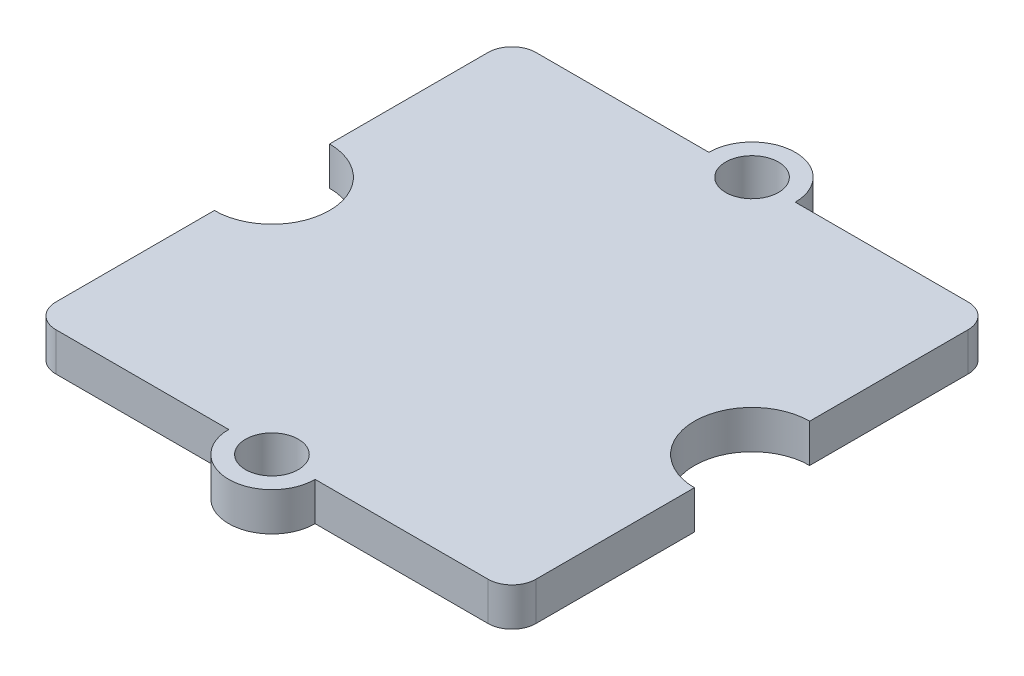
ISO-10303-21;
HEADER;
FILE_DESCRIPTION(('STEP AP214'),'2;1');
FILE_NAME('part.step','',(''),(''),'','','');
FILE_SCHEMA(('AUTOMOTIVE_DESIGN { 1 0 10303 214 1 1 1 1 }'));
ENDSEC;
DATA;
#1=APPLICATION_CONTEXT('core data for automotive mechanical design processes');
#2=APPLICATION_PROTOCOL_DEFINITION('international standard','automotive_design',2000,#1);
#3=PRODUCT_CONTEXT('',#1,'mechanical');
#4=PRODUCT('Part','Part','',(#3));
#5=PRODUCT_RELATED_PRODUCT_CATEGORY('part','',(#4));
#6=PRODUCT_DEFINITION_FORMATION('','',#4);
#7=PRODUCT_DEFINITION_CONTEXT('part definition',#1,'design');
#8=PRODUCT_DEFINITION('design','',#6,#7);
#9=PRODUCT_DEFINITION_SHAPE('','',#8);
#10=(LENGTH_UNIT() NAMED_UNIT(*) SI_UNIT(.MILLI.,.METRE.));
#11=(NAMED_UNIT(*) PLANE_ANGLE_UNIT() SI_UNIT($,.RADIAN.));
#12=(NAMED_UNIT(*) SI_UNIT($,.STERADIAN.) SOLID_ANGLE_UNIT());
#13=UNCERTAINTY_MEASURE_WITH_UNIT(LENGTH_MEASURE(1.E-05),#10,'distance_accuracy_value','');
#14=(GEOMETRIC_REPRESENTATION_CONTEXT(3) GLOBAL_UNCERTAINTY_ASSIGNED_CONTEXT((#13)) GLOBAL_UNIT_ASSIGNED_CONTEXT((#10,
#11,#12)) REPRESENTATION_CONTEXT('',''));
#15=CARTESIAN_POINT('',(0.,0.,0.));
#16=DIRECTION('',(0.,0.,1.));
#17=DIRECTION('',(1.,0.,0.));
#18=AXIS2_PLACEMENT_3D('',#15,#16,#17);
#19=CARTESIAN_POINT('',(0.,1.6,10.));
#20=DIRECTION('',(0.,-1.,0.));
#21=DIRECTION('',(0.,0.,-1.));
#22=AXIS2_PLACEMENT_3D('',#19,#20,#21);
#23=CYLINDRICAL_SURFACE('',#22,1.8);
#24=CARTESIAN_POINT('',(0.,0.,10.));
#25=DIRECTION('',(0.,1.,0.));
#26=DIRECTION('',(0.,0.,1.));
#27=AXIS2_PLACEMENT_3D('',#24,#25,#26);
#28=CIRCLE('',#27,1.8);
#29=CARTESIAN_POINT('',(-1.8,0.,10.));
#30=VERTEX_POINT('',#29);
#31=CARTESIAN_POINT('',(1.8,0.,10.));
#32=VERTEX_POINT('',#31);
#33=EDGE_CURVE('E187',#30,#32,#28,.T.);
#34=ORIENTED_EDGE('',*,*,#33,.T.);
#35=DIRECTION('',(0.,-1.,0.));
#36=VECTOR('',#35,1.);
#37=CARTESIAN_POINT('',(1.8,1.6,10.));
#38=LINE('',#37,#36);
#39=CARTESIAN_POINT('',(1.8,1.6,10.));
#40=VERTEX_POINT('',#39);
#41=EDGE_CURVE('E11',#40,#32,#38,.T.);
#42=ORIENTED_EDGE('',*,*,#41,.F.);
#43=CARTESIAN_POINT('',(0.,1.6,10.));
#44=DIRECTION('',(0.,1.,0.));
#45=DIRECTION('',(0.,0.,1.));
#46=AXIS2_PLACEMENT_3D('',#43,#44,#45);
#47=CIRCLE('',#46,1.8);
#48=CARTESIAN_POINT('',(-1.8,1.6,10.));
#49=VERTEX_POINT('',#48);
#50=EDGE_CURVE('E228',#49,#40,#47,.T.);
#51=ORIENTED_EDGE('',*,*,#50,.F.);
#52=DIRECTION('',(0.,-1.,0.));
#53=VECTOR('',#52,1.);
#54=CARTESIAN_POINT('',(-1.8,1.6,10.));
#55=LINE('',#54,#53);
#56=EDGE_CURVE('E186',#49,#30,#55,.T.);
#57=ORIENTED_EDGE('',*,*,#56,.T.);
#58=EDGE_LOOP('',(#34,#42,#51,#57));
#59=FACE_BOUND('',#58,.T.);
#60=ADVANCED_FACE('F36',(#59),#23,.T.);
#61=CARTESIAN_POINT('',(0.,1.6,10.));
#62=DIRECTION('',(0.,0.,-1.));
#63=DIRECTION('',(-1.,0.,0.));
#64=AXIS2_PLACEMENT_3D('',#61,#62,#63);
#65=PLANE('',#64);
#66=DIRECTION('',(1.,0.,0.));
#67=VECTOR('',#66,1.);
#68=CARTESIAN_POINT('',(0.,0.,10.));
#69=LINE('',#68,#67);
#70=CARTESIAN_POINT('',(8.99999999999999,0.,10.));
#71=VERTEX_POINT('',#70);
#72=EDGE_CURVE('E190',#32,#71,#69,.T.);
#73=ORIENTED_EDGE('',*,*,#72,.T.);
#74=DIRECTION('',(0.,-1.,0.));
#75=VECTOR('',#74,1.);
#76=CARTESIAN_POINT('',(8.99999999999999,1.6,10.));
#77=LINE('',#76,#75);
#78=CARTESIAN_POINT('',(8.99999999999999,1.6,10.));
#79=VERTEX_POINT('',#78);
#80=EDGE_CURVE('E44',#79,#71,#77,.T.);
#81=ORIENTED_EDGE('',*,*,#80,.F.);
#82=DIRECTION('',(1.,0.,0.));
#83=VECTOR('',#82,1.);
#84=CARTESIAN_POINT('',(0.,1.6,10.));
#85=LINE('',#84,#83);
#86=EDGE_CURVE('E115',#40,#79,#85,.T.);
#87=ORIENTED_EDGE('',*,*,#86,.F.);
#88=ORIENTED_EDGE('',*,*,#41,.T.);
#89=EDGE_LOOP('',(#73,#81,#87,#88));
#90=FACE_BOUND('',#89,.T.);
#91=ADVANCED_FACE('F308',(#90),#65,.F.);
#92=CARTESIAN_POINT('',(9.,1.6,9.00000000000001));
#93=DIRECTION('',(0.,-1.,0.));
#94=DIRECTION('',(0.,0.,-1.));
#95=AXIS2_PLACEMENT_3D('',#92,#93,#94);
#96=CYLINDRICAL_SURFACE('',#95,1.);
#97=CARTESIAN_POINT('',(9.,0.,9.00000000000001));
#98=DIRECTION('',(0.,1.,0.));
#99=DIRECTION('',(0.,0.,1.));
#100=AXIS2_PLACEMENT_3D('',#97,#98,#99);
#101=CIRCLE('',#100,1.);
#102=CARTESIAN_POINT('',(10.,0.,9.));
#103=VERTEX_POINT('',#102);
#104=EDGE_CURVE('E192',#71,#103,#101,.T.);
#105=ORIENTED_EDGE('',*,*,#104,.T.);
#106=DIRECTION('',(0.,-1.,0.));
#107=VECTOR('',#106,1.);
#108=CARTESIAN_POINT('',(10.,1.6,9.));
#109=LINE('',#108,#107);
#110=CARTESIAN_POINT('',(10.,1.6,9.));
#111=VERTEX_POINT('',#110);
#112=EDGE_CURVE('E250',#111,#103,#109,.T.);
#113=ORIENTED_EDGE('',*,*,#112,.F.);
#114=CARTESIAN_POINT('',(9.,1.6,9.00000000000001));
#115=DIRECTION('',(0.,1.,0.));
#116=DIRECTION('',(0.,0.,1.));
#117=AXIS2_PLACEMENT_3D('',#114,#115,#116);
#118=CIRCLE('',#117,1.);
#119=EDGE_CURVE('E258',#79,#111,#118,.T.);
#120=ORIENTED_EDGE('',*,*,#119,.F.);
#121=ORIENTED_EDGE('',*,*,#80,.T.);
#122=EDGE_LOOP('',(#105,#113,#120,#121));
#123=FACE_BOUND('',#122,.T.);
#124=ADVANCED_FACE('F256',(#123),#96,.T.);
#125=CARTESIAN_POINT('',(10.,1.6,0.));
#126=DIRECTION('',(-1.,0.,0.));
#127=DIRECTION('',(0.,0.,1.));
#128=AXIS2_PLACEMENT_3D('',#125,#126,#127);
#129=PLANE('',#128);
#130=DIRECTION('',(0.,0.,-1.));
#131=VECTOR('',#130,1.);
#132=CARTESIAN_POINT('',(10.,0.,0.));
#133=LINE('',#132,#131);
#134=CARTESIAN_POINT('',(10.,0.,2.40000000000001));
#135=VERTEX_POINT('',#134);
#136=EDGE_CURVE('E194',#103,#135,#133,.T.);
#137=ORIENTED_EDGE('',*,*,#136,.T.);
#138=DIRECTION('',(0.,-1.,0.));
#139=VECTOR('',#138,1.);
#140=CARTESIAN_POINT('',(10.,1.6,2.40000000000001));
#141=LINE('',#140,#139);
#142=CARTESIAN_POINT('',(10.,1.6,2.40000000000001));
#143=VERTEX_POINT('',#142);
#144=EDGE_CURVE('E248',#143,#135,#141,.T.);
#145=ORIENTED_EDGE('',*,*,#144,.F.);
#146=DIRECTION('',(0.,0.,-1.));
#147=VECTOR('',#146,1.);
#148=CARTESIAN_POINT('',(10.,1.6,0.));
#149=LINE('',#148,#147);
#150=EDGE_CURVE('E271',#111,#143,#149,.T.);
#151=ORIENTED_EDGE('',*,*,#150,.F.);
#152=ORIENTED_EDGE('',*,*,#112,.T.);
#153=EDGE_LOOP('',(#137,#145,#151,#152));
#154=FACE_BOUND('',#153,.T.);
#155=ADVANCED_FACE('F268',(#154),#129,.F.);
#156=CARTESIAN_POINT('',(10.,1.6,0.));
#157=DIRECTION('',(0.,-1.,0.));
#158=DIRECTION('',(0.,0.,-1.));
#159=AXIS2_PLACEMENT_3D('',#156,#157,#158);
#160=CYLINDRICAL_SURFACE('',#159,2.4);
#161=CARTESIAN_POINT('',(10.,0.,0.));
#162=DIRECTION('',(0.,1.,0.));
#163=DIRECTION('',(0.,0.,1.));
#164=AXIS2_PLACEMENT_3D('',#161,#162,#163);
#165=CIRCLE('',#164,2.4);
#166=CARTESIAN_POINT('',(10.,0.,-2.39999999999999));
#167=VERTEX_POINT('',#166);
#168=EDGE_CURVE('E197',#167,#135,#165,.T.);
#169=ORIENTED_EDGE('',*,*,#168,.F.);
#170=DIRECTION('',(0.,-1.,0.));
#171=VECTOR('',#170,1.);
#172=CARTESIAN_POINT('',(10.,1.6,-2.39999999999999));
#173=LINE('',#172,#171);
#174=CARTESIAN_POINT('',(10.,1.6,-2.39999999999999));
#175=VERTEX_POINT('',#174);
#176=EDGE_CURVE('E246',#175,#167,#173,.T.);
#177=ORIENTED_EDGE('',*,*,#176,.F.);
#178=CARTESIAN_POINT('',(10.,1.6,0.));
#179=DIRECTION('',(0.,1.,0.));
#180=DIRECTION('',(0.,0.,1.));
#181=AXIS2_PLACEMENT_3D('',#178,#179,#180);
#182=CIRCLE('',#181,2.4);
#183=EDGE_CURVE('E273',#175,#143,#182,.T.);
#184=ORIENTED_EDGE('',*,*,#183,.T.);
#185=ORIENTED_EDGE('',*,*,#144,.T.);
#186=EDGE_LOOP('',(#169,#177,#184,#185));
#187=FACE_BOUND('',#186,.T.);
#188=ADVANCED_FACE('F337',(#187),#160,.F.);
#189=CARTESIAN_POINT('',(10.,0.,-8.99999999999999));
#190=VERTEX_POINT('',#189);
#191=EDGE_CURVE('E198',#167,#190,#133,.T.);
#192=ORIENTED_EDGE('',*,*,#191,.T.);
#193=DIRECTION('',(0.,-1.,0.));
#194=VECTOR('',#193,1.);
#195=CARTESIAN_POINT('',(10.,1.6,-8.99999999999999));
#196=LINE('',#195,#194);
#197=CARTESIAN_POINT('',(10.,1.6,-8.99999999999999));
#198=VERTEX_POINT('',#197);
#199=EDGE_CURVE('E244',#198,#190,#196,.T.);
#200=ORIENTED_EDGE('',*,*,#199,.F.);
#201=EDGE_CURVE('E275',#175,#198,#149,.T.);
#202=ORIENTED_EDGE('',*,*,#201,.F.);
#203=ORIENTED_EDGE('',*,*,#176,.T.);
#204=EDGE_LOOP('',(#192,#200,#202,#203));
#205=FACE_BOUND('',#204,.T.);
#206=ADVANCED_FACE('F339',(#205),#129,.F.);
#207=CARTESIAN_POINT('',(9.,1.6,-8.99999999999999));
#208=DIRECTION('',(0.,-1.,0.));
#209=DIRECTION('',(0.,0.,-1.));
#210=AXIS2_PLACEMENT_3D('',#207,#208,#209);
#211=CYLINDRICAL_SURFACE('',#210,1.);
#212=CARTESIAN_POINT('',(9.,0.,-8.99999999999999));
#213=DIRECTION('',(0.,1.,0.));
#214=DIRECTION('',(0.,0.,1.));
#215=AXIS2_PLACEMENT_3D('',#212,#213,#214);
#216=CIRCLE('',#215,1.);
#217=CARTESIAN_POINT('',(8.99999999999999,0.,-9.99999999999999));
#218=VERTEX_POINT('',#217);
#219=EDGE_CURVE('E201',#218,#190,#216,.F.);
#220=ORIENTED_EDGE('',*,*,#219,.F.);
#221=DIRECTION('',(0.,-1.,0.));
#222=VECTOR('',#221,1.);
#223=CARTESIAN_POINT('',(8.99999999999999,1.6,-9.99999999999999));
#224=LINE('',#223,#222);
#225=CARTESIAN_POINT('',(8.99999999999999,1.6,-9.99999999999999));
#226=VERTEX_POINT('',#225);
#227=EDGE_CURVE('E242',#226,#218,#224,.T.);
#228=ORIENTED_EDGE('',*,*,#227,.F.);
#229=CARTESIAN_POINT('',(9.,1.6,-8.99999999999999));
#230=DIRECTION('',(0.,1.,0.));
#231=DIRECTION('',(0.,0.,1.));
#232=AXIS2_PLACEMENT_3D('',#229,#230,#231);
#233=CIRCLE('',#232,1.);
#234=EDGE_CURVE('E278',#226,#198,#233,.F.);
#235=ORIENTED_EDGE('',*,*,#234,.T.);
#236=ORIENTED_EDGE('',*,*,#199,.T.);
#237=EDGE_LOOP('',(#220,#228,#235,#236));
#238=FACE_BOUND('',#237,.T.);
#239=ADVANCED_FACE('F352',(#238),#211,.T.);
#240=CARTESIAN_POINT('',(0.,1.6,-9.99999999999999));
#241=DIRECTION('',(0.,0.,-1.));
#242=DIRECTION('',(-1.,0.,0.));
#243=AXIS2_PLACEMENT_3D('',#240,#241,#242);
#244=PLANE('',#243);
#245=DIRECTION('',(1.,0.,0.));
#246=VECTOR('',#245,1.);
#247=CARTESIAN_POINT('',(0.,0.,-9.99999999999999));
#248=LINE('',#247,#246);
#249=CARTESIAN_POINT('',(1.8,0.,-9.99999999999999));
#250=VERTEX_POINT('',#249);
#251=EDGE_CURVE('E204',#250,#218,#248,.T.);
#252=ORIENTED_EDGE('',*,*,#251,.F.);
#253=DIRECTION('',(0.,-1.,0.));
#254=VECTOR('',#253,1.);
#255=CARTESIAN_POINT('',(1.8,1.6,-9.99999999999999));
#256=LINE('',#255,#254);
#257=CARTESIAN_POINT('',(1.8,1.6,-9.99999999999999));
#258=VERTEX_POINT('',#257);
#259=EDGE_CURVE('E240',#258,#250,#256,.T.);
#260=ORIENTED_EDGE('',*,*,#259,.F.);
#261=DIRECTION('',(1.,0.,0.));
#262=VECTOR('',#261,1.);
#263=CARTESIAN_POINT('',(0.,1.6,-9.99999999999999));
#264=LINE('',#263,#262);
#265=EDGE_CURVE('E283',#258,#226,#264,.T.);
#266=ORIENTED_EDGE('',*,*,#265,.T.);
#267=ORIENTED_EDGE('',*,*,#227,.T.);
#268=EDGE_LOOP('',(#252,#260,#266,#267));
#269=FACE_BOUND('',#268,.T.);
#270=ADVANCED_FACE('F359',(#269),#244,.T.);
#271=CARTESIAN_POINT('',(0.,1.6,-9.99999999999999));
#272=DIRECTION('',(0.,-1.,0.));
#273=DIRECTION('',(0.,0.,-1.));
#274=AXIS2_PLACEMENT_3D('',#271,#272,#273);
#275=CYLINDRICAL_SURFACE('',#274,1.8);
#276=CARTESIAN_POINT('',(0.,0.,-9.99999999999999));
#277=DIRECTION('',(0.,1.,0.));
#278=DIRECTION('',(0.,0.,1.));
#279=AXIS2_PLACEMENT_3D('',#276,#277,#278);
#280=CIRCLE('',#279,1.8);
#281=CARTESIAN_POINT('',(-1.8,0.,-9.99999999999999));
#282=VERTEX_POINT('',#281);
#283=EDGE_CURVE('E207',#250,#282,#280,.T.);
#284=ORIENTED_EDGE('',*,*,#283,.T.);
#285=DIRECTION('',(0.,-1.,0.));
#286=VECTOR('',#285,1.);
#287=CARTESIAN_POINT('',(-1.8,1.6,-9.99999999999999));
#288=LINE('',#287,#286);
#289=CARTESIAN_POINT('',(-1.8,1.6,-9.99999999999999));
#290=VERTEX_POINT('',#289);
#291=EDGE_CURVE('E238',#290,#282,#288,.T.);
#292=ORIENTED_EDGE('',*,*,#291,.F.);
#293=CARTESIAN_POINT('',(0.,1.6,-9.99999999999999));
#294=DIRECTION('',(0.,1.,0.));
#295=DIRECTION('',(0.,0.,1.));
#296=AXIS2_PLACEMENT_3D('',#293,#294,#295);
#297=CIRCLE('',#296,1.8);
#298=EDGE_CURVE('E287',#258,#290,#297,.T.);
#299=ORIENTED_EDGE('',*,*,#298,.F.);
#300=ORIENTED_EDGE('',*,*,#259,.T.);
#301=EDGE_LOOP('',(#284,#292,#299,#300));
#302=FACE_BOUND('',#301,.T.);
#303=ADVANCED_FACE('F366',(#302),#275,.T.);
#304=CARTESIAN_POINT('',(-8.99999999999999,0.,-9.99999999999999));
#305=VERTEX_POINT('',#304);
#306=EDGE_CURVE('E208',#305,#282,#248,.T.);
#307=ORIENTED_EDGE('',*,*,#306,.F.);
#308=DIRECTION('',(0.,-1.,0.));
#309=VECTOR('',#308,1.);
#310=CARTESIAN_POINT('',(-8.99999999999999,1.6,-9.99999999999999));
#311=LINE('',#310,#309);
#312=CARTESIAN_POINT('',(-8.99999999999999,1.6,-9.99999999999999));
#313=VERTEX_POINT('',#312);
#314=EDGE_CURVE('E236',#313,#305,#311,.T.);
#315=ORIENTED_EDGE('',*,*,#314,.F.);
#316=EDGE_CURVE('E289',#313,#290,#264,.T.);
#317=ORIENTED_EDGE('',*,*,#316,.T.);
#318=ORIENTED_EDGE('',*,*,#291,.T.);
#319=EDGE_LOOP('',(#307,#315,#317,#318));
#320=FACE_BOUND('',#319,.T.);
#321=ADVANCED_FACE('F369',(#320),#244,.T.);
#322=CARTESIAN_POINT('',(-9.,1.6,-8.99999999999999));
#323=DIRECTION('',(0.,-1.,0.));
#324=DIRECTION('',(0.,0.,-1.));
#325=AXIS2_PLACEMENT_3D('',#322,#323,#324);
#326=CYLINDRICAL_SURFACE('',#325,1.);
#327=CARTESIAN_POINT('',(-9.,0.,-8.99999999999999));
#328=DIRECTION('',(0.,1.,0.));
#329=DIRECTION('',(0.,0.,1.));
#330=AXIS2_PLACEMENT_3D('',#327,#328,#329);
#331=CIRCLE('',#330,1.);
#332=CARTESIAN_POINT('',(-10.,0.,-8.99999999999999));
#333=VERTEX_POINT('',#332);
#334=EDGE_CURVE('E211',#333,#305,#331,.F.);
#335=ORIENTED_EDGE('',*,*,#334,.F.);
#336=DIRECTION('',(0.,-1.,0.));
#337=VECTOR('',#336,1.);
#338=CARTESIAN_POINT('',(-10.,1.6,-8.99999999999999));
#339=LINE('',#338,#337);
#340=CARTESIAN_POINT('',(-10.,1.6,-8.99999999999999));
#341=VERTEX_POINT('',#340);
#342=EDGE_CURVE('E234',#341,#333,#339,.T.);
#343=ORIENTED_EDGE('',*,*,#342,.F.);
#344=CARTESIAN_POINT('',(-9.,1.6,-8.99999999999999));
#345=DIRECTION('',(0.,1.,0.));
#346=DIRECTION('',(0.,0.,1.));
#347=AXIS2_PLACEMENT_3D('',#344,#345,#346);
#348=CIRCLE('',#347,1.);
#349=EDGE_CURVE('E292',#341,#313,#348,.F.);
#350=ORIENTED_EDGE('',*,*,#349,.T.);
#351=ORIENTED_EDGE('',*,*,#314,.T.);
#352=EDGE_LOOP('',(#335,#343,#350,#351));
#353=FACE_BOUND('',#352,.T.);
#354=ADVANCED_FACE('F382',(#353),#326,.T.);
#355=CARTESIAN_POINT('',(-10.,1.6,0.));
#356=DIRECTION('',(-1.,0.,0.));
#357=DIRECTION('',(0.,0.,1.));
#358=AXIS2_PLACEMENT_3D('',#355,#356,#357);
#359=PLANE('',#358);
#360=DIRECTION('',(0.,0.,-1.));
#361=VECTOR('',#360,1.);
#362=CARTESIAN_POINT('',(-10.,0.,0.));
#363=LINE('',#362,#361);
#364=CARTESIAN_POINT('',(-10.,0.,-2.39999999999999));
#365=VERTEX_POINT('',#364);
#366=EDGE_CURVE('E214',#365,#333,#363,.T.);
#367=ORIENTED_EDGE('',*,*,#366,.F.);
#368=DIRECTION('',(0.,-1.,0.));
#369=VECTOR('',#368,1.);
#370=CARTESIAN_POINT('',(-10.,1.6,-2.39999999999999));
#371=LINE('',#370,#369);
#372=CARTESIAN_POINT('',(-10.,1.6,-2.39999999999999));
#373=VERTEX_POINT('',#372);
#374=EDGE_CURVE('E232',#373,#365,#371,.T.);
#375=ORIENTED_EDGE('',*,*,#374,.F.);
#376=DIRECTION('',(0.,0.,-1.));
#377=VECTOR('',#376,1.);
#378=CARTESIAN_POINT('',(-10.,1.6,0.));
#379=LINE('',#378,#377);
#380=EDGE_CURVE('E174',#373,#341,#379,.T.);
#381=ORIENTED_EDGE('',*,*,#380,.T.);
#382=ORIENTED_EDGE('',*,*,#342,.T.);
#383=EDGE_LOOP('',(#367,#375,#381,#382));
#384=FACE_BOUND('',#383,.T.);
#385=ADVANCED_FACE('F389',(#384),#359,.T.);
#386=CARTESIAN_POINT('',(-10.,1.6,0.));
#387=DIRECTION('',(0.,-1.,0.));
#388=DIRECTION('',(0.,0.,-1.));
#389=AXIS2_PLACEMENT_3D('',#386,#387,#388);
#390=CYLINDRICAL_SURFACE('',#389,2.4);
#391=CARTESIAN_POINT('',(-10.,0.,0.));
#392=DIRECTION('',(0.,1.,0.));
#393=DIRECTION('',(0.,0.,1.));
#394=AXIS2_PLACEMENT_3D('',#391,#392,#393);
#395=CIRCLE('',#394,2.4);
#396=CARTESIAN_POINT('',(-10.,0.,2.40000000000001));
#397=VERTEX_POINT('',#396);
#398=EDGE_CURVE('E217',#397,#365,#395,.T.);
#399=ORIENTED_EDGE('',*,*,#398,.F.);
#400=DIRECTION('',(0.,-1.,0.));
#401=VECTOR('',#400,1.);
#402=CARTESIAN_POINT('',(-10.,1.6,2.40000000000001));
#403=LINE('',#402,#401);
#404=CARTESIAN_POINT('',(-10.,1.6,2.40000000000001));
#405=VERTEX_POINT('',#404);
#406=EDGE_CURVE('E164',#405,#397,#403,.T.);
#407=ORIENTED_EDGE('',*,*,#406,.F.);
#408=CARTESIAN_POINT('',(-10.,1.6,0.));
#409=DIRECTION('',(0.,1.,0.));
#410=DIRECTION('',(0.,0.,1.));
#411=AXIS2_PLACEMENT_3D('',#408,#409,#410);
#412=CIRCLE('',#411,2.4);
#413=EDGE_CURVE('E172',#405,#373,#412,.T.);
#414=ORIENTED_EDGE('',*,*,#413,.T.);
#415=ORIENTED_EDGE('',*,*,#374,.T.);
#416=EDGE_LOOP('',(#399,#407,#414,#415));
#417=FACE_BOUND('',#416,.T.);
#418=ADVANCED_FACE('F298',(#417),#390,.F.);
#419=CARTESIAN_POINT('',(-10.,0.,9.));
#420=VERTEX_POINT('',#419);
#421=EDGE_CURVE('E159',#420,#397,#363,.T.);
#422=ORIENTED_EDGE('',*,*,#421,.F.);
#423=DIRECTION('',(0.,-1.,0.));
#424=VECTOR('',#423,1.);
#425=CARTESIAN_POINT('',(-10.,1.6,9.));
#426=LINE('',#425,#424);
#427=CARTESIAN_POINT('',(-10.,1.6,9.));
#428=VERTEX_POINT('',#427);
#429=EDGE_CURVE('E154',#428,#420,#426,.T.);
#430=ORIENTED_EDGE('',*,*,#429,.F.);
#431=EDGE_CURVE('E157',#428,#405,#379,.T.);
#432=ORIENTED_EDGE('',*,*,#431,.T.);
#433=ORIENTED_EDGE('',*,*,#406,.T.);
#434=EDGE_LOOP('',(#422,#430,#432,#433));
#435=FACE_BOUND('',#434,.T.);
#436=ADVANCED_FACE('F156',(#435),#359,.T.);
#437=CARTESIAN_POINT('',(-9.,1.6,9.00000000000001));
#438=DIRECTION('',(0.,-1.,0.));
#439=DIRECTION('',(0.,0.,-1.));
#440=AXIS2_PLACEMENT_3D('',#437,#438,#439);
#441=CYLINDRICAL_SURFACE('',#440,1.);
#442=CARTESIAN_POINT('',(-9.,0.,9.00000000000001));
#443=DIRECTION('',(0.,1.,0.));
#444=DIRECTION('',(0.,0.,1.));
#445=AXIS2_PLACEMENT_3D('',#442,#443,#444);
#446=CIRCLE('',#445,1.);
#447=CARTESIAN_POINT('',(-8.99999999999999,0.,10.));
#448=VERTEX_POINT('',#447);
#449=EDGE_CURVE('E220',#448,#420,#446,.F.);
#450=ORIENTED_EDGE('',*,*,#449,.F.);
#451=DIRECTION('',(0.,-1.,0.));
#452=VECTOR('',#451,1.);
#453=CARTESIAN_POINT('',(-8.99999999999999,1.6,10.));
#454=LINE('',#453,#452);
#455=CARTESIAN_POINT('',(-8.99999999999999,1.6,10.));
#456=VERTEX_POINT('',#455);
#457=EDGE_CURVE('E104',#456,#448,#454,.T.);
#458=ORIENTED_EDGE('',*,*,#457,.F.);
#459=CARTESIAN_POINT('',(-9.,1.6,9.00000000000001));
#460=DIRECTION('',(0.,1.,0.));
#461=DIRECTION('',(0.,0.,1.));
#462=AXIS2_PLACEMENT_3D('',#459,#460,#461);
#463=CIRCLE('',#462,1.);
#464=EDGE_CURVE('E169',#456,#428,#463,.F.);
#465=ORIENTED_EDGE('',*,*,#464,.T.);
#466=ORIENTED_EDGE('',*,*,#429,.T.);
#467=EDGE_LOOP('',(#450,#458,#465,#466));
#468=FACE_BOUND('',#467,.T.);
#469=ADVANCED_FACE('F175',(#468),#441,.T.);
#470=CARTESIAN_POINT('',(0.,1.6,-9.99999999999999));
#471=DIRECTION('',(0.,-1.,0.));
#472=DIRECTION('',(0.,0.,-1.));
#473=AXIS2_PLACEMENT_3D('',#470,#471,#472);
#474=CYLINDRICAL_SURFACE('',#473,1.1);
#475=CARTESIAN_POINT('',(0.,1.6,-9.99999999999999));
#476=DIRECTION('',(0.,1.,0.));
#477=DIRECTION('',(0.,0.,1.));
#478=AXIS2_PLACEMENT_3D('',#475,#476,#477);
#479=CIRCLE('',#478,1.1);
#480=CARTESIAN_POINT('',(0.,1.6,-8.9));
#481=VERTEX_POINT('',#480);
#482=EDGE_CURVE('E177',#481,#481,#479,.T.);
#483=ORIENTED_EDGE('',*,*,#482,.T.);
#484=EDGE_LOOP('',(#483));
#485=FACE_BOUND('',#484,.T.);
#486=CARTESIAN_POINT('',(0.,0.,-9.99999999999999));
#487=DIRECTION('',(0.,1.,0.));
#488=DIRECTION('',(0.,0.,1.));
#489=AXIS2_PLACEMENT_3D('',#486,#487,#488);
#490=CIRCLE('',#489,1.1);
#491=CARTESIAN_POINT('',(0.,0.,-8.9));
#492=VERTEX_POINT('',#491);
#493=EDGE_CURVE('E222',#492,#492,#490,.T.);
#494=ORIENTED_EDGE('',*,*,#493,.F.);
#495=EDGE_LOOP('',(#494));
#496=FACE_BOUND('',#495,.T.);
#497=ADVANCED_FACE('F306',(#485,#496),#474,.F.);
#498=EDGE_CURVE('E107',#448,#30,#69,.T.);
#499=ORIENTED_EDGE('',*,*,#498,.T.);
#500=ORIENTED_EDGE('',*,*,#56,.F.);
#501=EDGE_CURVE('E52',#456,#49,#85,.T.);
#502=ORIENTED_EDGE('',*,*,#501,.F.);
#503=ORIENTED_EDGE('',*,*,#457,.T.);
#504=EDGE_LOOP('',(#499,#500,#502,#503));
#505=FACE_BOUND('',#504,.T.);
#506=ADVANCED_FACE('F303',(#505),#65,.F.);
#507=CARTESIAN_POINT('',(0.,1.6,10.));
#508=DIRECTION('',(0.,-1.,0.));
#509=DIRECTION('',(0.,0.,-1.));
#510=AXIS2_PLACEMENT_3D('',#507,#508,#509);
#511=CYLINDRICAL_SURFACE('',#510,1.1);
#512=CARTESIAN_POINT('',(0.,1.6,10.));
#513=DIRECTION('',(0.,1.,0.));
#514=DIRECTION('',(0.,0.,1.));
#515=AXIS2_PLACEMENT_3D('',#512,#513,#514);
#516=CIRCLE('',#515,1.1);
#517=CARTESIAN_POINT('',(0.,1.6,11.1));
#518=VERTEX_POINT('',#517);
#519=EDGE_CURVE('E183',#518,#518,#516,.T.);
#520=ORIENTED_EDGE('',*,*,#519,.T.);
#521=EDGE_LOOP('',(#520));
#522=FACE_BOUND('',#521,.T.);
#523=CARTESIAN_POINT('',(0.,0.,10.));
#524=DIRECTION('',(0.,1.,0.));
#525=DIRECTION('',(0.,0.,1.));
#526=AXIS2_PLACEMENT_3D('',#523,#524,#525);
#527=CIRCLE('',#526,1.1);
#528=CARTESIAN_POINT('',(0.,0.,11.1));
#529=VERTEX_POINT('',#528);
#530=EDGE_CURVE('E225',#529,#529,#527,.T.);
#531=ORIENTED_EDGE('',*,*,#530,.F.);
#532=EDGE_LOOP('',(#531));
#533=FACE_BOUND('',#532,.T.);
#534=ADVANCED_FACE('F305',(#522,#533),#511,.F.);
#535=CARTESIAN_POINT('',(0.,1.6,0.));
#536=DIRECTION('',(0.,1.,0.));
#537=DIRECTION('',(0.,0.,1.));
#538=AXIS2_PLACEMENT_3D('',#535,#536,#537);
#539=PLANE('',#538);
#540=ORIENTED_EDGE('',*,*,#50,.T.);
#541=ORIENTED_EDGE('',*,*,#86,.T.);
#542=ORIENTED_EDGE('',*,*,#119,.T.);
#543=ORIENTED_EDGE('',*,*,#150,.T.);
#544=ORIENTED_EDGE('',*,*,#183,.F.);
#545=ORIENTED_EDGE('',*,*,#201,.T.);
#546=ORIENTED_EDGE('',*,*,#234,.F.);
#547=ORIENTED_EDGE('',*,*,#265,.F.);
#548=ORIENTED_EDGE('',*,*,#298,.T.);
#549=ORIENTED_EDGE('',*,*,#316,.F.);
#550=ORIENTED_EDGE('',*,*,#349,.F.);
#551=ORIENTED_EDGE('',*,*,#380,.F.);
#552=ORIENTED_EDGE('',*,*,#413,.F.);
#553=ORIENTED_EDGE('',*,*,#431,.F.);
#554=ORIENTED_EDGE('',*,*,#464,.F.);
#555=ORIENTED_EDGE('',*,*,#501,.T.);
#556=EDGE_LOOP('',(#540,#541,#542,#543,#544,#545,#546,#547,#548,#549,#550,#551,#552,#553,#554,#555));
#557=FACE_BOUND('',#556,.T.);
#558=ORIENTED_EDGE('',*,*,#482,.F.);
#559=EDGE_LOOP('',(#558));
#560=FACE_BOUND('',#559,.T.);
#561=ORIENTED_EDGE('',*,*,#519,.F.);
#562=EDGE_LOOP('',(#561));
#563=FACE_BOUND('',#562,.T.);
#564=ADVANCED_FACE('F167',(#557,#560,#563),#539,.T.);
#565=CARTESIAN_POINT('',(0.,0.,0.));
#566=DIRECTION('',(0.,1.,0.));
#567=DIRECTION('',(0.,0.,1.));
#568=AXIS2_PLACEMENT_3D('',#565,#566,#567);
#569=PLANE('',#568);
#570=ORIENTED_EDGE('',*,*,#33,.F.);
#571=ORIENTED_EDGE('',*,*,#498,.F.);
#572=ORIENTED_EDGE('',*,*,#449,.T.);
#573=ORIENTED_EDGE('',*,*,#421,.T.);
#574=ORIENTED_EDGE('',*,*,#398,.T.);
#575=ORIENTED_EDGE('',*,*,#366,.T.);
#576=ORIENTED_EDGE('',*,*,#334,.T.);
#577=ORIENTED_EDGE('',*,*,#306,.T.);
#578=ORIENTED_EDGE('',*,*,#283,.F.);
#579=ORIENTED_EDGE('',*,*,#251,.T.);
#580=ORIENTED_EDGE('',*,*,#219,.T.);
#581=ORIENTED_EDGE('',*,*,#191,.F.);
#582=ORIENTED_EDGE('',*,*,#168,.T.);
#583=ORIENTED_EDGE('',*,*,#136,.F.);
#584=ORIENTED_EDGE('',*,*,#104,.F.);
#585=ORIENTED_EDGE('',*,*,#72,.F.);
#586=EDGE_LOOP('',(#570,#571,#572,#573,#574,#575,#576,#577,#578,#579,#580,#581,#582,#583,#584,#585));
#587=FACE_BOUND('',#586,.T.);
#588=ORIENTED_EDGE('',*,*,#493,.T.);
#589=EDGE_LOOP('',(#588));
#590=FACE_BOUND('',#589,.T.);
#591=ORIENTED_EDGE('',*,*,#530,.T.);
#592=EDGE_LOOP('',(#591));
#593=FACE_BOUND('',#592,.T.);
#594=ADVANCED_FACE('F262',(#587,#590,#593),#569,.F.);
#595=CLOSED_SHELL('',(#60,#91,#124,#155,#188,#206,#239,#270,#303,#321,#354,#385,#418,#436,#469,
#497,#506,#534,#564,#594));
#596=MANIFOLD_SOLID_BREP('B2',#595);
#597=ADVANCED_BREP_SHAPE_REPRESENTATION('',(#18,#596),#14);
#598=SHAPE_DEFINITION_REPRESENTATION(#9,#597);
ENDSEC;
END-ISO-10303-21;
